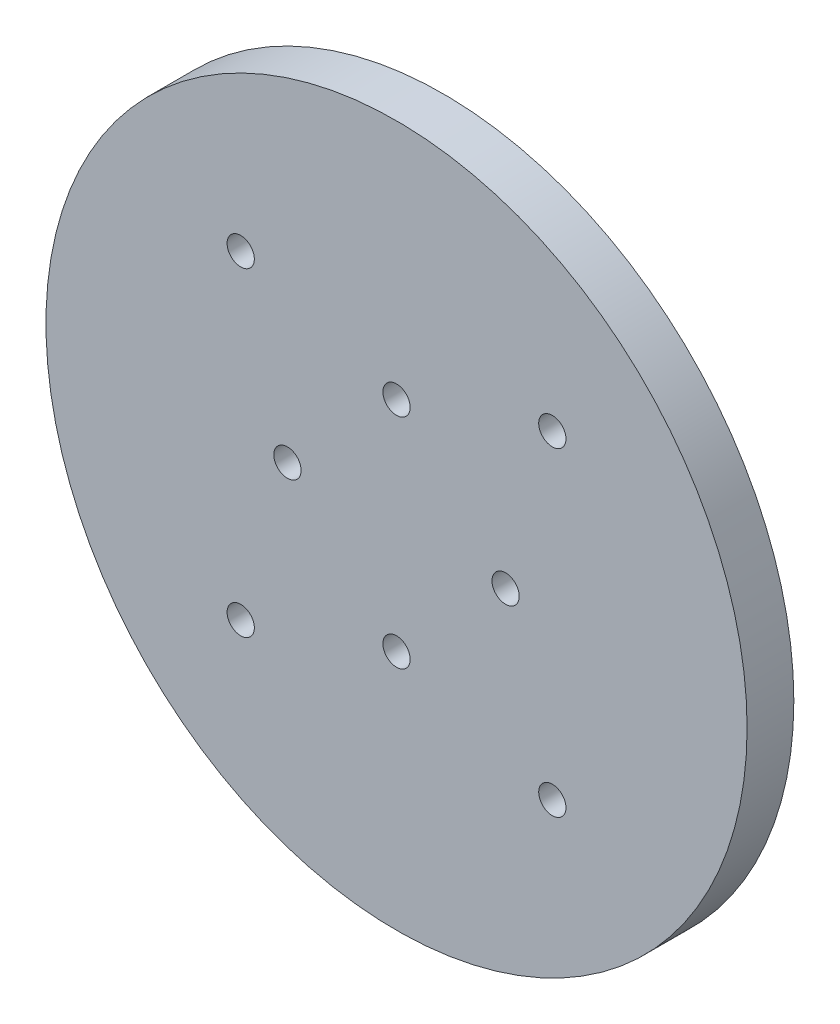
ISO-10303-21;
HEADER;
FILE_DESCRIPTION(('STEP AP214'),'2;1');
FILE_NAME('part.step','',(''),(''),'','','');
FILE_SCHEMA(('AUTOMOTIVE_DESIGN { 1 0 10303 214 1 1 1 1 }'));
ENDSEC;
DATA;
#1=APPLICATION_CONTEXT('core data for automotive mechanical design processes');
#2=APPLICATION_PROTOCOL_DEFINITION('international standard','automotive_design',2000,#1);
#3=PRODUCT_CONTEXT('',#1,'mechanical');
#4=PRODUCT('Part','Part','',(#3));
#5=PRODUCT_RELATED_PRODUCT_CATEGORY('part','',(#4));
#6=PRODUCT_DEFINITION_FORMATION('','',#4);
#7=PRODUCT_DEFINITION_CONTEXT('part definition',#1,'design');
#8=PRODUCT_DEFINITION('design','',#6,#7);
#9=PRODUCT_DEFINITION_SHAPE('','',#8);
#10=(LENGTH_UNIT() NAMED_UNIT(*) SI_UNIT(.MILLI.,.METRE.));
#11=(NAMED_UNIT(*) PLANE_ANGLE_UNIT() SI_UNIT($,.RADIAN.));
#12=(NAMED_UNIT(*) SI_UNIT($,.STERADIAN.) SOLID_ANGLE_UNIT());
#13=UNCERTAINTY_MEASURE_WITH_UNIT(LENGTH_MEASURE(1.E-05),#10,'distance_accuracy_value','');
#14=(GEOMETRIC_REPRESENTATION_CONTEXT(3) GLOBAL_UNCERTAINTY_ASSIGNED_CONTEXT((#13)) GLOBAL_UNIT_ASSIGNED_CONTEXT((#10,
#11,#12)) REPRESENTATION_CONTEXT('',''));
#15=CARTESIAN_POINT('',(0.,0.,0.));
#16=DIRECTION('',(0.,0.,1.));
#17=DIRECTION('',(1.,0.,0.));
#18=AXIS2_PLACEMENT_3D('',#15,#16,#17);
#19=CARTESIAN_POINT('',(0.,0.,6.));
#20=DIRECTION('',(0.,0.,1.));
#21=DIRECTION('',(1.,0.,0.));
#22=AXIS2_PLACEMENT_3D('',#19,#20,#21);
#23=PLANE('',#22);
#24=CARTESIAN_POINT('',(19.9999914227974,20.5,6.));
#25=DIRECTION('',(0.,0.,1.));
#26=DIRECTION('',(1.,0.,0.));
#27=AXIS2_PLACEMENT_3D('',#24,#25,#26);
#28=CIRCLE('',#27,1.75);
#29=CARTESIAN_POINT('',(21.7499914227974,20.5,6.));
#30=VERTEX_POINT('',#29);
#31=EDGE_CURVE('E101',#30,#30,#28,.T.);
#32=ORIENTED_EDGE('',*,*,#31,.F.);
#33=EDGE_LOOP('',(#32));
#34=FACE_BOUND('',#33,.T.);
#35=CARTESIAN_POINT('',(19.9999914227974,-20.5,6.));
#36=DIRECTION('',(0.,0.,1.));
#37=DIRECTION('',(1.,0.,0.));
#38=AXIS2_PLACEMENT_3D('',#35,#36,#37);
#39=CIRCLE('',#38,1.75);
#40=CARTESIAN_POINT('',(21.7499914227974,-20.5,6.));
#41=VERTEX_POINT('',#40);
#42=EDGE_CURVE('E105',#41,#41,#39,.T.);
#43=ORIENTED_EDGE('',*,*,#42,.F.);
#44=EDGE_LOOP('',(#43));
#45=FACE_BOUND('',#44,.T.);
#46=CARTESIAN_POINT('',(-14.,0.,6.));
#47=DIRECTION('',(0.,0.,-1.));
#48=DIRECTION('',(-1.,0.,0.));
#49=AXIS2_PLACEMENT_3D('',#46,#47,#48);
#50=CIRCLE('',#49,1.75);
#51=CARTESIAN_POINT('',(-15.75,0.,6.));
#52=VERTEX_POINT('',#51);
#53=EDGE_CURVE('E110',#52,#52,#50,.T.);
#54=ORIENTED_EDGE('',*,*,#53,.T.);
#55=EDGE_LOOP('',(#54));
#56=FACE_BOUND('',#55,.T.);
#57=CARTESIAN_POINT('',(0.,-14.,6.));
#58=DIRECTION('',(0.,0.,-1.));
#59=DIRECTION('',(-1.,0.,0.));
#60=AXIS2_PLACEMENT_3D('',#57,#58,#59);
#61=CIRCLE('',#60,1.75);
#62=CARTESIAN_POINT('',(-1.74999999999995,-14.,6.));
#63=VERTEX_POINT('',#62);
#64=EDGE_CURVE('E123',#63,#63,#61,.T.);
#65=ORIENTED_EDGE('',*,*,#64,.T.);
#66=EDGE_LOOP('',(#65));
#67=FACE_BOUND('',#66,.T.);
#68=CARTESIAN_POINT('',(14.,0.,6.));
#69=DIRECTION('',(0.,0.,-1.));
#70=DIRECTION('',(-1.,0.,0.));
#71=AXIS2_PLACEMENT_3D('',#68,#69,#70);
#72=CIRCLE('',#71,1.75);
#73=CARTESIAN_POINT('',(12.25,0.,6.));
#74=VERTEX_POINT('',#73);
#75=EDGE_CURVE('E131',#74,#74,#72,.T.);
#76=ORIENTED_EDGE('',*,*,#75,.T.);
#77=EDGE_LOOP('',(#76));
#78=FACE_BOUND('',#77,.T.);
#79=CARTESIAN_POINT('',(-1.46707548625861E-13,14.,6.));
#80=DIRECTION('',(0.,0.,-1.));
#81=DIRECTION('',(-1.,0.,0.));
#82=AXIS2_PLACEMENT_3D('',#79,#80,#81);
#83=CIRCLE('',#82,1.75);
#84=CARTESIAN_POINT('',(-1.75000000000015,14.,6.));
#85=VERTEX_POINT('',#84);
#86=EDGE_CURVE('E109',#85,#85,#83,.T.);
#87=ORIENTED_EDGE('',*,*,#86,.T.);
#88=EDGE_LOOP('',(#87));
#89=FACE_BOUND('',#88,.T.);
#90=CARTESIAN_POINT('',(0.,0.,6.));
#91=DIRECTION('',(0.,0.,1.));
#92=DIRECTION('',(1.,0.,0.));
#93=AXIS2_PLACEMENT_3D('',#90,#91,#92);
#94=CIRCLE('',#93,45.);
#95=CARTESIAN_POINT('',(45.,0.,6.));
#96=VERTEX_POINT('',#95);
#97=EDGE_CURVE('E58',#96,#96,#94,.T.);
#98=ORIENTED_EDGE('',*,*,#97,.T.);
#99=EDGE_LOOP('',(#98));
#100=FACE_BOUND('',#99,.T.);
#101=CARTESIAN_POINT('',(-19.9999914227974,20.5,6.));
#102=DIRECTION('',(0.,0.,-1.));
#103=DIRECTION('',(-1.,0.,0.));
#104=AXIS2_PLACEMENT_3D('',#101,#102,#103);
#105=CIRCLE('',#104,1.75);
#106=CARTESIAN_POINT('',(-21.7499914227974,20.5,6.));
#107=VERTEX_POINT('',#106);
#108=EDGE_CURVE('E95',#107,#107,#105,.T.);
#109=ORIENTED_EDGE('',*,*,#108,.T.);
#110=EDGE_LOOP('',(#109));
#111=FACE_BOUND('',#110,.T.);
#112=CARTESIAN_POINT('',(-19.9999914227974,-20.5,6.));
#113=DIRECTION('',(0.,0.,-1.));
#114=DIRECTION('',(-1.,0.,0.));
#115=AXIS2_PLACEMENT_3D('',#112,#113,#114);
#116=CIRCLE('',#115,1.75);
#117=CARTESIAN_POINT('',(-21.7499914227974,-20.5,6.));
#118=VERTEX_POINT('',#117);
#119=EDGE_CURVE('E90',#118,#118,#116,.T.);
#120=ORIENTED_EDGE('',*,*,#119,.T.);
#121=EDGE_LOOP('',(#120));
#122=FACE_BOUND('',#121,.T.);
#123=ADVANCED_FACE('F43',(#34,#45,#56,#67,#78,#89,#100,#111,#122),#23,.T.);
#124=CARTESIAN_POINT('',(0.,0.,0.));
#125=DIRECTION('',(0.,0.,1.));
#126=DIRECTION('',(1.,0.,0.));
#127=AXIS2_PLACEMENT_3D('',#124,#125,#126);
#128=PLANE('',#127);
#129=CARTESIAN_POINT('',(19.9999914227974,-20.5,0.));
#130=DIRECTION('',(0.,0.,1.));
#131=DIRECTION('',(1.,0.,0.));
#132=AXIS2_PLACEMENT_3D('',#129,#130,#131);
#133=CIRCLE('',#132,2.9);
#134=CARTESIAN_POINT('',(22.8999914227974,-20.5,0.));
#135=VERTEX_POINT('',#134);
#136=EDGE_CURVE('E392',#135,#135,#133,.T.);
#137=ORIENTED_EDGE('',*,*,#136,.T.);
#138=EDGE_LOOP('',(#137));
#139=FACE_BOUND('',#138,.T.);
#140=CARTESIAN_POINT('',(-19.9999914227974,-20.5,0.));
#141=DIRECTION('',(0.,0.,1.));
#142=DIRECTION('',(1.,0.,0.));
#143=AXIS2_PLACEMENT_3D('',#140,#141,#142);
#144=CIRCLE('',#143,2.9);
#145=CARTESIAN_POINT('',(-17.0999914227974,-20.5,0.));
#146=VERTEX_POINT('',#145);
#147=EDGE_CURVE('E420',#146,#146,#144,.T.);
#148=ORIENTED_EDGE('',*,*,#147,.T.);
#149=EDGE_LOOP('',(#148));
#150=FACE_BOUND('',#149,.T.);
#151=CARTESIAN_POINT('',(-19.9999914227974,20.5,0.));
#152=DIRECTION('',(0.,0.,1.));
#153=DIRECTION('',(1.,0.,0.));
#154=AXIS2_PLACEMENT_3D('',#151,#152,#153);
#155=CIRCLE('',#154,2.9);
#156=CARTESIAN_POINT('',(-17.0999914227974,20.5,0.));
#157=VERTEX_POINT('',#156);
#158=EDGE_CURVE('E406',#157,#157,#155,.T.);
#159=ORIENTED_EDGE('',*,*,#158,.T.);
#160=EDGE_LOOP('',(#159));
#161=FACE_BOUND('',#160,.T.);
#162=CARTESIAN_POINT('',(19.9999914227974,20.5,0.));
#163=DIRECTION('',(0.,0.,1.));
#164=DIRECTION('',(1.,0.,0.));
#165=AXIS2_PLACEMENT_3D('',#162,#163,#164);
#166=CIRCLE('',#165,2.9);
#167=CARTESIAN_POINT('',(22.8999914227974,20.5,0.));
#168=VERTEX_POINT('',#167);
#169=EDGE_CURVE('E403',#168,#168,#166,.T.);
#170=ORIENTED_EDGE('',*,*,#169,.T.);
#171=EDGE_LOOP('',(#170));
#172=FACE_BOUND('',#171,.T.);
#173=CARTESIAN_POINT('',(0.,0.,0.));
#174=DIRECTION('',(0.,0.,-1.));
#175=DIRECTION('',(-1.,0.,0.));
#176=AXIS2_PLACEMENT_3D('',#173,#174,#175);
#177=CIRCLE('',#176,22.);
#178=CARTESIAN_POINT('',(-22.,0.,0.));
#179=VERTEX_POINT('',#178);
#180=EDGE_CURVE('E52',#179,#179,#177,.T.);
#181=ORIENTED_EDGE('',*,*,#180,.F.);
#182=EDGE_LOOP('',(#181));
#183=FACE_BOUND('',#182,.T.);
#184=CARTESIAN_POINT('',(0.,0.,0.));
#185=DIRECTION('',(0.,0.,1.));
#186=DIRECTION('',(1.,0.,0.));
#187=AXIS2_PLACEMENT_3D('',#184,#185,#186);
#188=CIRCLE('',#187,45.);
#189=CARTESIAN_POINT('',(45.,0.,0.));
#190=VERTEX_POINT('',#189);
#191=EDGE_CURVE('E67',#190,#190,#188,.T.);
#192=ORIENTED_EDGE('',*,*,#191,.F.);
#193=EDGE_LOOP('',(#192));
#194=FACE_BOUND('',#193,.T.);
#195=ADVANCED_FACE('F170',(#139,#150,#161,#172,#183,#194),#128,.F.);
#196=CARTESIAN_POINT('',(0.,0.,6.));
#197=DIRECTION('',(0.,0.,-1.));
#198=DIRECTION('',(-1.,0.,0.));
#199=AXIS2_PLACEMENT_3D('',#196,#197,#198);
#200=CYLINDRICAL_SURFACE('',#199,45.);
#201=ORIENTED_EDGE('',*,*,#97,.F.);
#202=EDGE_LOOP('',(#201));
#203=FACE_BOUND('',#202,.T.);
#204=ORIENTED_EDGE('',*,*,#191,.T.);
#205=EDGE_LOOP('',(#204));
#206=FACE_BOUND('',#205,.T.);
#207=ADVANCED_FACE('F45',(#203,#206),#200,.T.);
#208=CARTESIAN_POINT('',(0.,0.,-6.));
#209=DIRECTION('',(0.,0.,1.));
#210=DIRECTION('',(1.,0.,0.));
#211=AXIS2_PLACEMENT_3D('',#208,#209,#210);
#212=CYLINDRICAL_SURFACE('',#211,22.);
#213=CARTESIAN_POINT('',(0.,0.,-6.));
#214=DIRECTION('',(0.,0.,-1.));
#215=DIRECTION('',(-1.,0.,0.));
#216=AXIS2_PLACEMENT_3D('',#213,#214,#215);
#217=CIRCLE('',#216,22.);
#218=CARTESIAN_POINT('',(-22.,0.,-6.));
#219=VERTEX_POINT('',#218);
#220=EDGE_CURVE('E64',#219,#219,#217,.T.);
#221=ORIENTED_EDGE('',*,*,#220,.F.);
#222=EDGE_LOOP('',(#221));
#223=FACE_BOUND('',#222,.T.);
#224=ORIENTED_EDGE('',*,*,#180,.T.);
#225=EDGE_LOOP('',(#224));
#226=FACE_BOUND('',#225,.T.);
#227=ADVANCED_FACE('F166',(#223,#226),#212,.T.);
#228=CARTESIAN_POINT('',(0.,0.,-6.));
#229=DIRECTION('',(0.,0.,-1.));
#230=DIRECTION('',(-1.,0.,0.));
#231=AXIS2_PLACEMENT_3D('',#228,#229,#230);
#232=PLANE('',#231);
#233=CARTESIAN_POINT('',(0.,0.,-6.));
#234=DIRECTION('',(0.,0.,-1.));
#235=DIRECTION('',(-1.,0.,0.));
#236=AXIS2_PLACEMENT_3D('',#233,#234,#235);
#237=CIRCLE('',#236,20.1);
#238=CARTESIAN_POINT('',(-20.1,0.,-6.));
#239=VERTEX_POINT('',#238);
#240=EDGE_CURVE('E10',#239,#239,#237,.T.);
#241=ORIENTED_EDGE('',*,*,#240,.F.);
#242=EDGE_LOOP('',(#241));
#243=FACE_BOUND('',#242,.T.);
#244=ORIENTED_EDGE('',*,*,#220,.T.);
#245=EDGE_LOOP('',(#244));
#246=FACE_BOUND('',#245,.T.);
#247=ADVANCED_FACE('F161',(#243,#246),#232,.T.);
#248=CARTESIAN_POINT('',(0.,0.,-10.7));
#249=DIRECTION('',(0.,0.,1.));
#250=DIRECTION('',(1.,0.,0.));
#251=AXIS2_PLACEMENT_3D('',#248,#249,#250);
#252=CYLINDRICAL_SURFACE('',#251,20.1);
#253=CARTESIAN_POINT('',(0.,0.,-10.7));
#254=DIRECTION('',(0.,0.,-1.));
#255=DIRECTION('',(-1.,0.,0.));
#256=AXIS2_PLACEMENT_3D('',#253,#254,#255);
#257=CIRCLE('',#256,20.1);
#258=CARTESIAN_POINT('',(-20.1,0.,-10.7));
#259=VERTEX_POINT('',#258);
#260=EDGE_CURVE('E62',#259,#259,#257,.T.);
#261=ORIENTED_EDGE('',*,*,#260,.F.);
#262=EDGE_LOOP('',(#261));
#263=FACE_BOUND('',#262,.T.);
#264=ORIENTED_EDGE('',*,*,#240,.T.);
#265=EDGE_LOOP('',(#264));
#266=FACE_BOUND('',#265,.T.);
#267=ADVANCED_FACE('F154',(#263,#266),#252,.T.);
#268=CARTESIAN_POINT('',(0.,0.,-10.7));
#269=DIRECTION('',(0.,0.,-1.));
#270=DIRECTION('',(-1.,0.,0.));
#271=AXIS2_PLACEMENT_3D('',#268,#269,#270);
#272=PLANE('',#271);
#273=CARTESIAN_POINT('',(0.,0.,-10.7));
#274=DIRECTION('',(0.,0.,-1.));
#275=DIRECTION('',(-1.,0.,0.));
#276=AXIS2_PLACEMENT_3D('',#273,#274,#275);
#277=CIRCLE('',#276,18.1);
#278=CARTESIAN_POINT('',(-18.1,0.,-10.7));
#279=VERTEX_POINT('',#278);
#280=EDGE_CURVE('E114',#279,#279,#277,.T.);
#281=ORIENTED_EDGE('',*,*,#280,.F.);
#282=EDGE_LOOP('',(#281));
#283=FACE_BOUND('',#282,.T.);
#284=ORIENTED_EDGE('',*,*,#260,.T.);
#285=EDGE_LOOP('',(#284));
#286=FACE_BOUND('',#285,.T.);
#287=ADVANCED_FACE('F151',(#283,#286),#272,.T.);
#288=CARTESIAN_POINT('',(0.,0.,0.299999999999998));
#289=DIRECTION('',(0.,0.,-1.));
#290=DIRECTION('',(-1.,0.,0.));
#291=AXIS2_PLACEMENT_3D('',#288,#289,#290);
#292=CYLINDRICAL_SURFACE('',#291,18.1);
#293=CARTESIAN_POINT('',(0.,0.,0.299999999999998));
#294=DIRECTION('',(0.,0.,-1.));
#295=DIRECTION('',(-1.,0.,0.));
#296=AXIS2_PLACEMENT_3D('',#293,#294,#295);
#297=CIRCLE('',#296,18.1);
#298=CARTESIAN_POINT('',(-18.1,0.,0.299999999999998));
#299=VERTEX_POINT('',#298);
#300=EDGE_CURVE('E142',#299,#299,#297,.T.);
#301=ORIENTED_EDGE('',*,*,#300,.F.);
#302=EDGE_LOOP('',(#301));
#303=FACE_BOUND('',#302,.T.);
#304=ORIENTED_EDGE('',*,*,#280,.T.);
#305=EDGE_LOOP('',(#304));
#306=FACE_BOUND('',#305,.T.);
#307=ADVANCED_FACE('F149',(#303,#306),#292,.F.);
#308=CARTESIAN_POINT('',(0.,0.,0.299999999999998));
#309=DIRECTION('',(0.,0.,-1.));
#310=DIRECTION('',(-1.,0.,0.));
#311=AXIS2_PLACEMENT_3D('',#308,#309,#310);
#312=PLANE('',#311);
#313=CARTESIAN_POINT('',(-14.,0.,0.299999999999998));
#314=DIRECTION('',(0.,0.,-1.));
#315=DIRECTION('',(-1.,0.,0.));
#316=AXIS2_PLACEMENT_3D('',#313,#314,#315);
#317=CIRCLE('',#316,1.75);
#318=CARTESIAN_POINT('',(-15.75,0.,0.299999999999998));
#319=VERTEX_POINT('',#318);
#320=EDGE_CURVE('E115',#319,#319,#317,.T.);
#321=ORIENTED_EDGE('',*,*,#320,.F.);
#322=EDGE_LOOP('',(#321));
#323=FACE_BOUND('',#322,.T.);
#324=CARTESIAN_POINT('',(0.,-14.,0.299999999999998));
#325=DIRECTION('',(0.,0.,-1.));
#326=DIRECTION('',(-1.,0.,0.));
#327=AXIS2_PLACEMENT_3D('',#324,#325,#326);
#328=CIRCLE('',#327,1.75);
#329=CARTESIAN_POINT('',(-1.74999999999995,-14.,0.299999999999998));
#330=VERTEX_POINT('',#329);
#331=EDGE_CURVE('E119',#330,#330,#328,.T.);
#332=ORIENTED_EDGE('',*,*,#331,.F.);
#333=EDGE_LOOP('',(#332));
#334=FACE_BOUND('',#333,.T.);
#335=CARTESIAN_POINT('',(14.,0.,0.299999999999998));
#336=DIRECTION('',(0.,0.,-1.));
#337=DIRECTION('',(-1.,0.,0.));
#338=AXIS2_PLACEMENT_3D('',#335,#336,#337);
#339=CIRCLE('',#338,1.75);
#340=CARTESIAN_POINT('',(12.25,0.,0.299999999999998));
#341=VERTEX_POINT('',#340);
#342=EDGE_CURVE('E127',#341,#341,#339,.T.);
#343=ORIENTED_EDGE('',*,*,#342,.F.);
#344=EDGE_LOOP('',(#343));
#345=FACE_BOUND('',#344,.T.);
#346=CARTESIAN_POINT('',(-1.46707548625861E-13,14.,0.299999999999998));
#347=DIRECTION('',(0.,0.,-1.));
#348=DIRECTION('',(-1.,0.,0.));
#349=AXIS2_PLACEMENT_3D('',#346,#347,#348);
#350=CIRCLE('',#349,1.75);
#351=CARTESIAN_POINT('',(-1.75000000000015,14.,0.299999999999998));
#352=VERTEX_POINT('',#351);
#353=EDGE_CURVE('E135',#352,#352,#350,.T.);
#354=ORIENTED_EDGE('',*,*,#353,.F.);
#355=EDGE_LOOP('',(#354));
#356=FACE_BOUND('',#355,.T.);
#357=ORIENTED_EDGE('',*,*,#300,.T.);
#358=EDGE_LOOP('',(#357));
#359=FACE_BOUND('',#358,.T.);
#360=ADVANCED_FACE('F237',(#323,#334,#345,#356,#359),#312,.T.);
#361=CARTESIAN_POINT('',(-1.46707548625861E-13,14.,6.));
#362=DIRECTION('',(0.,0.,-1.));
#363=DIRECTION('',(-1.,0.,0.));
#364=AXIS2_PLACEMENT_3D('',#361,#362,#363);
#365=CYLINDRICAL_SURFACE('',#364,1.75);
#366=ORIENTED_EDGE('',*,*,#86,.F.);
#367=EDGE_LOOP('',(#366));
#368=FACE_BOUND('',#367,.T.);
#369=ORIENTED_EDGE('',*,*,#353,.T.);
#370=EDGE_LOOP('',(#369));
#371=FACE_BOUND('',#370,.T.);
#372=ADVANCED_FACE('F233',(#368,#371),#365,.F.);
#373=CARTESIAN_POINT('',(14.,0.,6.));
#374=DIRECTION('',(0.,0.,-1.));
#375=DIRECTION('',(-1.,0.,0.));
#376=AXIS2_PLACEMENT_3D('',#373,#374,#375);
#377=CYLINDRICAL_SURFACE('',#376,1.75);
#378=ORIENTED_EDGE('',*,*,#75,.F.);
#379=EDGE_LOOP('',(#378));
#380=FACE_BOUND('',#379,.T.);
#381=ORIENTED_EDGE('',*,*,#342,.T.);
#382=EDGE_LOOP('',(#381));
#383=FACE_BOUND('',#382,.T.);
#384=ADVANCED_FACE('F229',(#380,#383),#377,.F.);
#385=CARTESIAN_POINT('',(0.,-14.,6.));
#386=DIRECTION('',(0.,0.,-1.));
#387=DIRECTION('',(-1.,0.,0.));
#388=AXIS2_PLACEMENT_3D('',#385,#386,#387);
#389=CYLINDRICAL_SURFACE('',#388,1.75);
#390=ORIENTED_EDGE('',*,*,#64,.F.);
#391=EDGE_LOOP('',(#390));
#392=FACE_BOUND('',#391,.T.);
#393=ORIENTED_EDGE('',*,*,#331,.T.);
#394=EDGE_LOOP('',(#393));
#395=FACE_BOUND('',#394,.T.);
#396=ADVANCED_FACE('F225',(#392,#395),#389,.F.);
#397=CARTESIAN_POINT('',(-14.,0.,6.));
#398=DIRECTION('',(0.,0.,-1.));
#399=DIRECTION('',(-1.,0.,0.));
#400=AXIS2_PLACEMENT_3D('',#397,#398,#399);
#401=CYLINDRICAL_SURFACE('',#400,1.75);
#402=ORIENTED_EDGE('',*,*,#53,.F.);
#403=EDGE_LOOP('',(#402));
#404=FACE_BOUND('',#403,.T.);
#405=ORIENTED_EDGE('',*,*,#320,.T.);
#406=EDGE_LOOP('',(#405));
#407=FACE_BOUND('',#406,.T.);
#408=ADVANCED_FACE('F222',(#404,#407),#401,.F.);
#409=CARTESIAN_POINT('',(19.9999914227974,-20.5,6.));
#410=DIRECTION('',(0.,0.,-1.));
#411=DIRECTION('',(-1.,0.,0.));
#412=AXIS2_PLACEMENT_3D('',#409,#410,#411);
#413=CYLINDRICAL_SURFACE('',#412,1.75);
#414=CARTESIAN_POINT('',(19.9999914227974,-20.5,3.3));
#415=DIRECTION('',(0.,0.,1.));
#416=DIRECTION('',(1.,0.,0.));
#417=AXIS2_PLACEMENT_3D('',#414,#415,#416);
#418=CIRCLE('',#417,1.75);
#419=CARTESIAN_POINT('',(21.7499914227974,-20.5,3.3));
#420=VERTEX_POINT('',#419);
#421=EDGE_CURVE('E47',#420,#420,#418,.T.);
#422=ORIENTED_EDGE('',*,*,#421,.F.);
#423=EDGE_LOOP('',(#422));
#424=FACE_BOUND('',#423,.T.);
#425=ORIENTED_EDGE('',*,*,#42,.T.);
#426=EDGE_LOOP('',(#425));
#427=FACE_BOUND('',#426,.T.);
#428=ADVANCED_FACE('F215',(#424,#427),#413,.F.);
#429=CARTESIAN_POINT('',(19.9999914227974,20.5,6.));
#430=DIRECTION('',(0.,0.,-1.));
#431=DIRECTION('',(-1.,0.,0.));
#432=AXIS2_PLACEMENT_3D('',#429,#430,#431);
#433=CYLINDRICAL_SURFACE('',#432,1.75);
#434=CARTESIAN_POINT('',(19.9999914227974,20.5,3.3));
#435=DIRECTION('',(0.,0.,1.));
#436=DIRECTION('',(1.,0.,0.));
#437=AXIS2_PLACEMENT_3D('',#434,#435,#436);
#438=CIRCLE('',#437,1.75);
#439=CARTESIAN_POINT('',(21.7499914227974,20.5,3.3));
#440=VERTEX_POINT('',#439);
#441=EDGE_CURVE('E83',#440,#440,#438,.T.);
#442=ORIENTED_EDGE('',*,*,#441,.F.);
#443=EDGE_LOOP('',(#442));
#444=FACE_BOUND('',#443,.T.);
#445=ORIENTED_EDGE('',*,*,#31,.T.);
#446=EDGE_LOOP('',(#445));
#447=FACE_BOUND('',#446,.T.);
#448=ADVANCED_FACE('F205',(#444,#447),#433,.F.);
#449=CARTESIAN_POINT('',(-19.9999914227974,20.5,6.));
#450=DIRECTION('',(0.,0.,-1.));
#451=DIRECTION('',(-1.,0.,0.));
#452=AXIS2_PLACEMENT_3D('',#449,#450,#451);
#453=CYLINDRICAL_SURFACE('',#452,1.75);
#454=CARTESIAN_POINT('',(-19.9999914227974,20.5,3.3));
#455=DIRECTION('',(0.,0.,1.));
#456=DIRECTION('',(1.,0.,0.));
#457=AXIS2_PLACEMENT_3D('',#454,#455,#456);
#458=CIRCLE('',#457,1.75);
#459=CARTESIAN_POINT('',(-18.2499914227974,20.5,3.3));
#460=VERTEX_POINT('',#459);
#461=EDGE_CURVE('E79',#460,#460,#458,.F.);
#462=ORIENTED_EDGE('',*,*,#461,.T.);
#463=EDGE_LOOP('',(#462));
#464=FACE_BOUND('',#463,.T.);
#465=ORIENTED_EDGE('',*,*,#108,.F.);
#466=EDGE_LOOP('',(#465));
#467=FACE_BOUND('',#466,.T.);
#468=ADVANCED_FACE('F202',(#464,#467),#453,.F.);
#469=CARTESIAN_POINT('',(-19.9999914227974,-20.5,6.));
#470=DIRECTION('',(0.,0.,-1.));
#471=DIRECTION('',(-1.,0.,0.));
#472=AXIS2_PLACEMENT_3D('',#469,#470,#471);
#473=CYLINDRICAL_SURFACE('',#472,1.75);
#474=CARTESIAN_POINT('',(-19.9999914227974,-20.5,3.3));
#475=DIRECTION('',(0.,0.,1.));
#476=DIRECTION('',(1.,0.,0.));
#477=AXIS2_PLACEMENT_3D('',#474,#475,#476);
#478=CIRCLE('',#477,1.75);
#479=CARTESIAN_POINT('',(-18.2499914227974,-20.5,3.3));
#480=VERTEX_POINT('',#479);
#481=EDGE_CURVE('E75',#480,#480,#478,.F.);
#482=ORIENTED_EDGE('',*,*,#481,.T.);
#483=EDGE_LOOP('',(#482));
#484=FACE_BOUND('',#483,.T.);
#485=ORIENTED_EDGE('',*,*,#119,.F.);
#486=EDGE_LOOP('',(#485));
#487=FACE_BOUND('',#486,.T.);
#488=ADVANCED_FACE('F204',(#484,#487),#473,.F.);
#489=CARTESIAN_POINT('',(-19.9999914227974,-20.5,3.3));
#490=DIRECTION('',(0.,0.,1.));
#491=DIRECTION('',(1.,0.,0.));
#492=AXIS2_PLACEMENT_3D('',#489,#490,#491);
#493=PLANE('',#492);
#494=CARTESIAN_POINT('',(-19.9999914227974,-20.5,3.3));
#495=DIRECTION('',(0.,0.,1.));
#496=DIRECTION('',(1.,0.,0.));
#497=AXIS2_PLACEMENT_3D('',#494,#495,#496);
#498=CIRCLE('',#497,2.9);
#499=CARTESIAN_POINT('',(-17.0999914227974,-20.5,3.3));
#500=VERTEX_POINT('',#499);
#501=EDGE_CURVE('E396',#500,#500,#498,.T.);
#502=ORIENTED_EDGE('',*,*,#501,.F.);
#503=EDGE_LOOP('',(#502));
#504=FACE_BOUND('',#503,.T.);
#505=ORIENTED_EDGE('',*,*,#481,.F.);
#506=EDGE_LOOP('',(#505));
#507=FACE_BOUND('',#506,.T.);
#508=ADVANCED_FACE('F212',(#504,#507),#493,.F.);
#509=CARTESIAN_POINT('',(-19.9999914227974,-20.5,3.3));
#510=DIRECTION('',(0.,0.,-1.));
#511=DIRECTION('',(-1.,0.,0.));
#512=AXIS2_PLACEMENT_3D('',#509,#510,#511);
#513=CYLINDRICAL_SURFACE('',#512,2.9);
#514=ORIENTED_EDGE('',*,*,#501,.T.);
#515=EDGE_LOOP('',(#514));
#516=FACE_BOUND('',#515,.T.);
#517=ORIENTED_EDGE('',*,*,#147,.F.);
#518=EDGE_LOOP('',(#517));
#519=FACE_BOUND('',#518,.T.);
#520=ADVANCED_FACE('F317',(#516,#519),#513,.F.);
#521=CARTESIAN_POINT('',(-19.9999914227974,20.5,3.3));
#522=DIRECTION('',(0.,0.,1.));
#523=DIRECTION('',(1.,0.,0.));
#524=AXIS2_PLACEMENT_3D('',#521,#522,#523);
#525=PLANE('',#524);
#526=CARTESIAN_POINT('',(-19.9999914227974,20.5,3.3));
#527=DIRECTION('',(0.,0.,1.));
#528=DIRECTION('',(1.,0.,0.));
#529=AXIS2_PLACEMENT_3D('',#526,#527,#528);
#530=CIRCLE('',#529,2.9);
#531=CARTESIAN_POINT('',(-17.0999914227974,20.5,3.3));
#532=VERTEX_POINT('',#531);
#533=EDGE_CURVE('E414',#532,#532,#530,.T.);
#534=ORIENTED_EDGE('',*,*,#533,.F.);
#535=EDGE_LOOP('',(#534));
#536=FACE_BOUND('',#535,.T.);
#537=ORIENTED_EDGE('',*,*,#461,.F.);
#538=EDGE_LOOP('',(#537));
#539=FACE_BOUND('',#538,.T.);
#540=ADVANCED_FACE('F327',(#536,#539),#525,.F.);
#541=CARTESIAN_POINT('',(-19.9999914227974,20.5,3.3));
#542=DIRECTION('',(0.,0.,-1.));
#543=DIRECTION('',(-1.,0.,0.));
#544=AXIS2_PLACEMENT_3D('',#541,#542,#543);
#545=CYLINDRICAL_SURFACE('',#544,2.9);
#546=ORIENTED_EDGE('',*,*,#533,.T.);
#547=EDGE_LOOP('',(#546));
#548=FACE_BOUND('',#547,.T.);
#549=ORIENTED_EDGE('',*,*,#158,.F.);
#550=EDGE_LOOP('',(#549));
#551=FACE_BOUND('',#550,.T.);
#552=ADVANCED_FACE('F337',(#548,#551),#545,.F.);
#553=CARTESIAN_POINT('',(19.9999914227974,20.5,3.3));
#554=DIRECTION('',(0.,0.,-1.));
#555=DIRECTION('',(-1.,0.,0.));
#556=AXIS2_PLACEMENT_3D('',#553,#554,#555);
#557=CYLINDRICAL_SURFACE('',#556,2.9);
#558=CARTESIAN_POINT('',(19.9999914227974,20.5,3.3));
#559=DIRECTION('',(0.,0.,1.));
#560=DIRECTION('',(1.,0.,0.));
#561=AXIS2_PLACEMENT_3D('',#558,#559,#560);
#562=CIRCLE('',#561,2.9);
#563=CARTESIAN_POINT('',(22.8999914227974,20.5,3.3));
#564=VERTEX_POINT('',#563);
#565=EDGE_CURVE('E80',#564,#564,#562,.T.);
#566=ORIENTED_EDGE('',*,*,#565,.T.);
#567=EDGE_LOOP('',(#566));
#568=FACE_BOUND('',#567,.T.);
#569=ORIENTED_EDGE('',*,*,#169,.F.);
#570=EDGE_LOOP('',(#569));
#571=FACE_BOUND('',#570,.T.);
#572=ADVANCED_FACE('F347',(#568,#571),#557,.F.);
#573=CARTESIAN_POINT('',(19.9999914227974,20.5,3.3));
#574=DIRECTION('',(0.,0.,1.));
#575=DIRECTION('',(1.,0.,0.));
#576=AXIS2_PLACEMENT_3D('',#573,#574,#575);
#577=PLANE('',#576);
#578=ORIENTED_EDGE('',*,*,#441,.T.);
#579=EDGE_LOOP('',(#578));
#580=FACE_BOUND('',#579,.T.);
#581=ORIENTED_EDGE('',*,*,#565,.F.);
#582=EDGE_LOOP('',(#581));
#583=FACE_BOUND('',#582,.T.);
#584=ADVANCED_FACE('F357',(#580,#583),#577,.F.);
#585=CARTESIAN_POINT('',(19.9999914227974,-20.5,3.3));
#586=DIRECTION('',(0.,0.,-1.));
#587=DIRECTION('',(-1.,0.,0.));
#588=AXIS2_PLACEMENT_3D('',#585,#586,#587);
#589=CYLINDRICAL_SURFACE('',#588,2.9);
#590=CARTESIAN_POINT('',(19.9999914227974,-20.5,3.3));
#591=DIRECTION('',(0.,0.,1.));
#592=DIRECTION('',(1.,0.,0.));
#593=AXIS2_PLACEMENT_3D('',#590,#591,#592);
#594=CIRCLE('',#593,2.9);
#595=CARTESIAN_POINT('',(22.8999914227974,-20.5,3.3));
#596=VERTEX_POINT('',#595);
#597=EDGE_CURVE('E390',#596,#596,#594,.T.);
#598=ORIENTED_EDGE('',*,*,#597,.T.);
#599=EDGE_LOOP('',(#598));
#600=FACE_BOUND('',#599,.T.);
#601=ORIENTED_EDGE('',*,*,#136,.F.);
#602=EDGE_LOOP('',(#601));
#603=FACE_BOUND('',#602,.T.);
#604=ADVANCED_FACE('F366',(#600,#603),#589,.F.);
#605=CARTESIAN_POINT('',(19.9999914227974,-20.5,3.3));
#606=DIRECTION('',(0.,0.,1.));
#607=DIRECTION('',(1.,0.,0.));
#608=AXIS2_PLACEMENT_3D('',#605,#606,#607);
#609=PLANE('',#608);
#610=ORIENTED_EDGE('',*,*,#421,.T.);
#611=EDGE_LOOP('',(#610));
#612=FACE_BOUND('',#611,.T.);
#613=ORIENTED_EDGE('',*,*,#597,.F.);
#614=EDGE_LOOP('',(#613));
#615=FACE_BOUND('',#614,.T.);
#616=ADVANCED_FACE('F375',(#612,#615),#609,.F.);
#617=CLOSED_SHELL('',(#123,#195,#207,#227,#247,#267,#287,#307,#360,#372,#384,#396,#408,#428,
#448,#468,#488,#508,#520,#540,#552,#572,#584,#604,#616));
#618=MANIFOLD_SOLID_BREP('B2',#617);
#619=ADVANCED_BREP_SHAPE_REPRESENTATION('',(#18,#618),#14);
#620=SHAPE_DEFINITION_REPRESENTATION(#9,#619);
ENDSEC;
END-ISO-10303-21;
